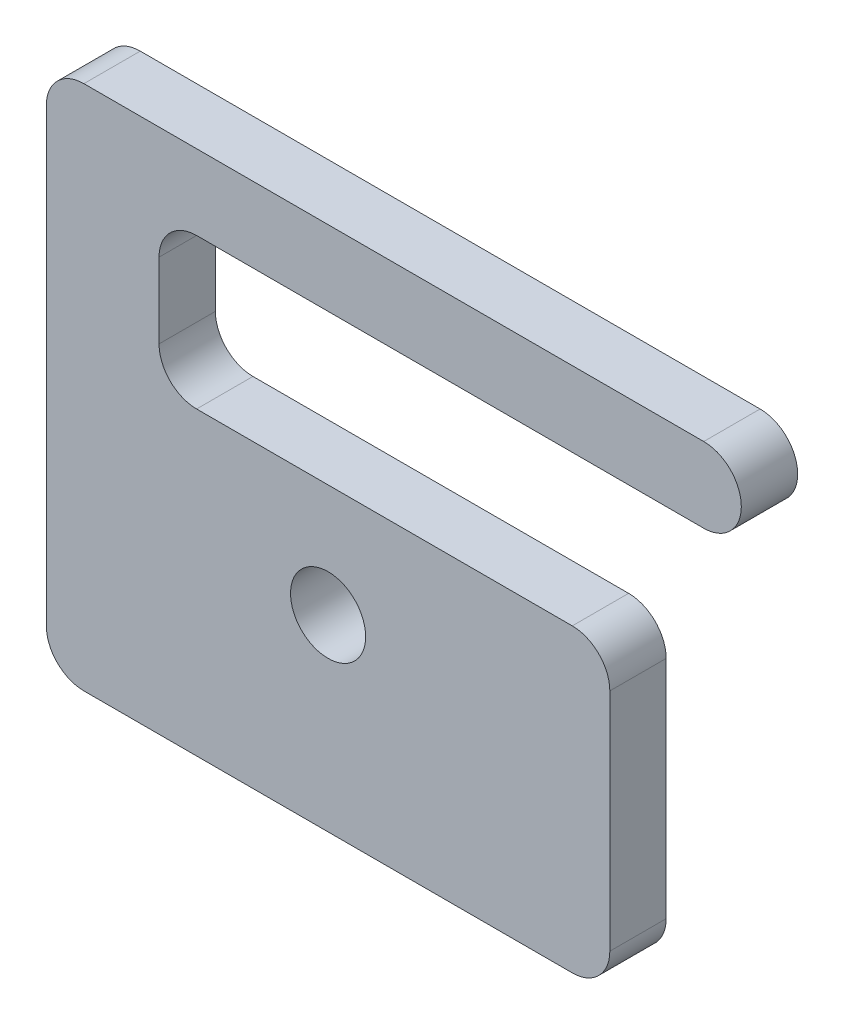
ISO-10303-21;
HEADER;
FILE_DESCRIPTION(('STEP AP214'),'2;1');
FILE_NAME('part.step','',(''),(''),'','','');
FILE_SCHEMA(('AUTOMOTIVE_DESIGN { 1 0 10303 214 1 1 1 1 }'));
ENDSEC;
DATA;
#1=APPLICATION_CONTEXT('core data for automotive mechanical design processes');
#2=APPLICATION_PROTOCOL_DEFINITION('international standard','automotive_design',2000,#1);
#3=PRODUCT_CONTEXT('',#1,'mechanical');
#4=PRODUCT('Part','Part','',(#3));
#5=PRODUCT_RELATED_PRODUCT_CATEGORY('part','',(#4));
#6=PRODUCT_DEFINITION_FORMATION('','',#4);
#7=PRODUCT_DEFINITION_CONTEXT('part definition',#1,'design');
#8=PRODUCT_DEFINITION('design','',#6,#7);
#9=PRODUCT_DEFINITION_SHAPE('','',#8);
#10=(LENGTH_UNIT() NAMED_UNIT(*) SI_UNIT(.MILLI.,.METRE.));
#11=(NAMED_UNIT(*) PLANE_ANGLE_UNIT() SI_UNIT($,.RADIAN.));
#12=(NAMED_UNIT(*) SI_UNIT($,.STERADIAN.) SOLID_ANGLE_UNIT());
#13=UNCERTAINTY_MEASURE_WITH_UNIT(LENGTH_MEASURE(1.E-05),#10,'distance_accuracy_value','');
#14=(GEOMETRIC_REPRESENTATION_CONTEXT(3) GLOBAL_UNCERTAINTY_ASSIGNED_CONTEXT((#13)) GLOBAL_UNIT_ASSIGNED_CONTEXT((#10,
#11,#12)) REPRESENTATION_CONTEXT('',''));
#15=CARTESIAN_POINT('',(0.,0.,0.));
#16=DIRECTION('',(0.,0.,1.));
#17=DIRECTION('',(1.,0.,0.));
#18=AXIS2_PLACEMENT_3D('',#15,#16,#17);
#19=CARTESIAN_POINT('',(-0.35,0.4,-0.15));
#20=DIRECTION('',(0.,0.,1.));
#21=DIRECTION('',(1.,0.,0.));
#22=AXIS2_PLACEMENT_3D('',#19,#20,#21);
#23=CYLINDRICAL_SURFACE('',#22,0.1);
#24=CARTESIAN_POINT('',(-0.35,0.4,0.));
#25=DIRECTION('',(0.,0.,-1.));
#26=DIRECTION('',(1.,0.,0.));
#27=AXIS2_PLACEMENT_3D('',#24,#25,#26);
#28=CIRCLE('',#27,0.1);
#29=CARTESIAN_POINT('',(-0.35,0.3,0.));
#30=VERTEX_POINT('',#29);
#31=CARTESIAN_POINT('',(-0.45,0.400000000000001,0.));
#32=VERTEX_POINT('',#31);
#33=EDGE_CURVE('E178',#30,#32,#28,.T.);
#34=ORIENTED_EDGE('',*,*,#33,.F.);
#35=DIRECTION('',(0.,0.,1.));
#36=VECTOR('',#35,1.);
#37=CARTESIAN_POINT('',(-0.35,0.3,-0.15));
#38=LINE('',#37,#36);
#39=CARTESIAN_POINT('',(-0.35,0.3,-0.15));
#40=VERTEX_POINT('',#39);
#41=EDGE_CURVE('E11',#40,#30,#38,.T.);
#42=ORIENTED_EDGE('',*,*,#41,.F.);
#43=CARTESIAN_POINT('',(-0.35,0.4,-0.15));
#44=DIRECTION('',(0.,0.,-1.));
#45=DIRECTION('',(1.,0.,0.));
#46=AXIS2_PLACEMENT_3D('',#43,#44,#45);
#47=CIRCLE('',#46,0.1);
#48=CARTESIAN_POINT('',(-0.45,0.400000000000001,-0.15));
#49=VERTEX_POINT('',#48);
#50=EDGE_CURVE('E231',#40,#49,#47,.T.);
#51=ORIENTED_EDGE('',*,*,#50,.T.);
#52=DIRECTION('',(0.,0.,1.));
#53=VECTOR('',#52,1.);
#54=CARTESIAN_POINT('',(-0.45,0.400000000000001,-0.15));
#55=LINE('',#54,#53);
#56=EDGE_CURVE('E42',#49,#32,#55,.T.);
#57=ORIENTED_EDGE('',*,*,#56,.T.);
#58=EDGE_LOOP('',(#34,#42,#51,#57));
#59=FACE_BOUND('',#58,.T.);
#60=ADVANCED_FACE('F39',(#59),#23,.F.);
#61=CARTESIAN_POINT('',(-0.35,0.3,-0.15));
#62=DIRECTION('',(0.,1.,0.));
#63=DIRECTION('',(0.,0.,1.));
#64=AXIS2_PLACEMENT_3D('',#61,#62,#63);
#65=PLANE('',#64);
#66=DIRECTION('',(-1.,0.,0.));
#67=VECTOR('',#66,1.);
#68=CARTESIAN_POINT('',(-0.35,0.3,0.));
#69=LINE('',#68,#67);
#70=CARTESIAN_POINT('',(0.65,0.3,0.));
#71=VERTEX_POINT('',#70);
#72=EDGE_CURVE('E228',#71,#30,#69,.T.);
#73=ORIENTED_EDGE('',*,*,#72,.F.);
#74=DIRECTION('',(0.,0.,1.));
#75=VECTOR('',#74,1.);
#76=CARTESIAN_POINT('',(0.65,0.3,-0.15));
#77=LINE('',#76,#75);
#78=CARTESIAN_POINT('',(0.65,0.3,-0.15));
#79=VERTEX_POINT('',#78);
#80=EDGE_CURVE('E49',#79,#71,#77,.T.);
#81=ORIENTED_EDGE('',*,*,#80,.F.);
#82=DIRECTION('',(-1.,0.,0.));
#83=VECTOR('',#82,1.);
#84=CARTESIAN_POINT('',(-0.35,0.3,-0.15));
#85=LINE('',#84,#83);
#86=EDGE_CURVE('E164',#79,#40,#85,.T.);
#87=ORIENTED_EDGE('',*,*,#86,.T.);
#88=ORIENTED_EDGE('',*,*,#41,.T.);
#89=EDGE_LOOP('',(#73,#81,#87,#88));
#90=FACE_BOUND('',#89,.T.);
#91=ADVANCED_FACE('F267',(#90),#65,.T.);
#92=CARTESIAN_POINT('',(0.65,0.2,-0.15));
#93=DIRECTION('',(0.,0.,1.));
#94=DIRECTION('',(1.,0.,0.));
#95=AXIS2_PLACEMENT_3D('',#92,#93,#94);
#96=CYLINDRICAL_SURFACE('',#95,0.1);
#97=CARTESIAN_POINT('',(0.65,0.2,0.));
#98=DIRECTION('',(0.,0.,1.));
#99=DIRECTION('',(-1.,0.,0.));
#100=AXIS2_PLACEMENT_3D('',#97,#98,#99);
#101=CIRCLE('',#100,0.1);
#102=CARTESIAN_POINT('',(0.75,0.199999999999999,0.));
#103=VERTEX_POINT('',#102);
#104=EDGE_CURVE('E150',#103,#71,#101,.T.);
#105=ORIENTED_EDGE('',*,*,#104,.F.);
#106=DIRECTION('',(0.,0.,1.));
#107=VECTOR('',#106,1.);
#108=CARTESIAN_POINT('',(0.75,0.199999999999999,-0.15));
#109=LINE('',#108,#107);
#110=CARTESIAN_POINT('',(0.75,0.199999999999999,-0.15));
#111=VERTEX_POINT('',#110);
#112=EDGE_CURVE('E145',#111,#103,#109,.T.);
#113=ORIENTED_EDGE('',*,*,#112,.F.);
#114=CARTESIAN_POINT('',(0.65,0.2,-0.15));
#115=DIRECTION('',(0.,0.,1.));
#116=DIRECTION('',(-1.,0.,0.));
#117=AXIS2_PLACEMENT_3D('',#114,#115,#116);
#118=CIRCLE('',#117,0.1);
#119=EDGE_CURVE('E148',#111,#79,#118,.T.);
#120=ORIENTED_EDGE('',*,*,#119,.T.);
#121=ORIENTED_EDGE('',*,*,#80,.T.);
#122=EDGE_LOOP('',(#105,#113,#120,#121));
#123=FACE_BOUND('',#122,.T.);
#124=ADVANCED_FACE('F147',(#123),#96,.T.);
#125=CARTESIAN_POINT('',(0.75,0.199999999999999,-0.15));
#126=DIRECTION('',(1.,0.,0.));
#127=DIRECTION('',(0.,1.,0.));
#128=AXIS2_PLACEMENT_3D('',#125,#126,#127);
#129=PLANE('',#128);
#130=DIRECTION('',(0.,1.,0.));
#131=VECTOR('',#130,1.);
#132=CARTESIAN_POINT('',(0.75,0.199999999999999,0.));
#133=LINE('',#132,#131);
#134=CARTESIAN_POINT('',(0.75,-0.4,0.));
#135=VERTEX_POINT('',#134);
#136=EDGE_CURVE('E223',#135,#103,#133,.T.);
#137=ORIENTED_EDGE('',*,*,#136,.F.);
#138=DIRECTION('',(0.,0.,1.));
#139=VECTOR('',#138,1.);
#140=CARTESIAN_POINT('',(0.75,-0.4,-0.15));
#141=LINE('',#140,#139);
#142=CARTESIAN_POINT('',(0.75,-0.4,-0.15));
#143=VERTEX_POINT('',#142);
#144=EDGE_CURVE('E156',#143,#135,#141,.T.);
#145=ORIENTED_EDGE('',*,*,#144,.F.);
#146=DIRECTION('',(0.,1.,0.));
#147=VECTOR('',#146,1.);
#148=CARTESIAN_POINT('',(0.75,0.199999999999999,-0.15));
#149=LINE('',#148,#147);
#150=EDGE_CURVE('E162',#143,#111,#149,.T.);
#151=ORIENTED_EDGE('',*,*,#150,.T.);
#152=ORIENTED_EDGE('',*,*,#112,.T.);
#153=EDGE_LOOP('',(#137,#145,#151,#152));
#154=FACE_BOUND('',#153,.T.);
#155=ADVANCED_FACE('F167',(#154),#129,.T.);
#156=CARTESIAN_POINT('',(0.65,-0.4,-0.15));
#157=DIRECTION('',(0.,0.,1.));
#158=DIRECTION('',(1.,0.,0.));
#159=AXIS2_PLACEMENT_3D('',#156,#157,#158);
#160=CYLINDRICAL_SURFACE('',#159,0.1);
#161=CARTESIAN_POINT('',(0.65,-0.4,0.));
#162=DIRECTION('',(0.,0.,1.));
#163=DIRECTION('',(1.,0.,0.));
#164=AXIS2_PLACEMENT_3D('',#161,#162,#163);
#165=CIRCLE('',#164,0.1);
#166=CARTESIAN_POINT('',(0.649999999999999,-0.5,0.));
#167=VERTEX_POINT('',#166);
#168=EDGE_CURVE('E219',#167,#135,#165,.T.);
#169=ORIENTED_EDGE('',*,*,#168,.F.);
#170=DIRECTION('',(0.,0.,1.));
#171=VECTOR('',#170,1.);
#172=CARTESIAN_POINT('',(0.649999999999999,-0.5,-0.15));
#173=LINE('',#172,#171);
#174=CARTESIAN_POINT('',(0.649999999999999,-0.5,-0.15));
#175=VERTEX_POINT('',#174);
#176=EDGE_CURVE('E237',#175,#167,#173,.T.);
#177=ORIENTED_EDGE('',*,*,#176,.F.);
#178=CARTESIAN_POINT('',(0.65,-0.4,-0.15));
#179=DIRECTION('',(0.,0.,1.));
#180=DIRECTION('',(1.,0.,0.));
#181=AXIS2_PLACEMENT_3D('',#178,#179,#180);
#182=CIRCLE('',#181,0.1);
#183=EDGE_CURVE('E169',#175,#143,#182,.T.);
#184=ORIENTED_EDGE('',*,*,#183,.T.);
#185=ORIENTED_EDGE('',*,*,#144,.T.);
#186=EDGE_LOOP('',(#169,#177,#184,#185));
#187=FACE_BOUND('',#186,.T.);
#188=ADVANCED_FACE('F280',(#187),#160,.T.);
#189=CARTESIAN_POINT('',(-0.649999999999999,-0.5,-0.15));
#190=DIRECTION('',(0.,-1.,0.));
#191=DIRECTION('',(0.,0.,-1.));
#192=AXIS2_PLACEMENT_3D('',#189,#190,#191);
#193=PLANE('',#192);
#194=DIRECTION('',(1.,0.,0.));
#195=VECTOR('',#194,1.);
#196=CARTESIAN_POINT('',(-0.649999999999999,-0.5,0.));
#197=LINE('',#196,#195);
#198=CARTESIAN_POINT('',(-0.649999999999999,-0.5,0.));
#199=VERTEX_POINT('',#198);
#200=EDGE_CURVE('E215',#199,#167,#197,.T.);
#201=ORIENTED_EDGE('',*,*,#200,.F.);
#202=DIRECTION('',(0.,0.,1.));
#203=VECTOR('',#202,1.);
#204=CARTESIAN_POINT('',(-0.649999999999999,-0.5,-0.15));
#205=LINE('',#204,#203);
#206=CARTESIAN_POINT('',(-0.649999999999999,-0.5,-0.15));
#207=VERTEX_POINT('',#206);
#208=EDGE_CURVE('E240',#207,#199,#205,.T.);
#209=ORIENTED_EDGE('',*,*,#208,.F.);
#210=DIRECTION('',(1.,0.,0.));
#211=VECTOR('',#210,1.);
#212=CARTESIAN_POINT('',(-0.649999999999999,-0.5,-0.15));
#213=LINE('',#212,#211);
#214=EDGE_CURVE('E172',#207,#175,#213,.T.);
#215=ORIENTED_EDGE('',*,*,#214,.T.);
#216=ORIENTED_EDGE('',*,*,#176,.T.);
#217=EDGE_LOOP('',(#201,#209,#215,#216));
#218=FACE_BOUND('',#217,.T.);
#219=ADVANCED_FACE('F283',(#218),#193,.T.);
#220=CARTESIAN_POINT('',(-0.65,-0.4,-0.15));
#221=DIRECTION('',(0.,0.,1.));
#222=DIRECTION('',(1.,0.,0.));
#223=AXIS2_PLACEMENT_3D('',#220,#221,#222);
#224=CYLINDRICAL_SURFACE('',#223,0.1);
#225=CARTESIAN_POINT('',(-0.65,-0.4,0.));
#226=DIRECTION('',(0.,0.,1.));
#227=DIRECTION('',(1.,0.,0.));
#228=AXIS2_PLACEMENT_3D('',#225,#226,#227);
#229=CIRCLE('',#228,0.1);
#230=CARTESIAN_POINT('',(-0.75,-0.399999999999999,0.));
#231=VERTEX_POINT('',#230);
#232=EDGE_CURVE('E211',#231,#199,#229,.T.);
#233=ORIENTED_EDGE('',*,*,#232,.F.);
#234=DIRECTION('',(0.,0.,1.));
#235=VECTOR('',#234,1.);
#236=CARTESIAN_POINT('',(-0.75,-0.399999999999999,-0.15));
#237=LINE('',#236,#235);
#238=CARTESIAN_POINT('',(-0.75,-0.399999999999999,-0.15));
#239=VERTEX_POINT('',#238);
#240=EDGE_CURVE('E243',#239,#231,#237,.T.);
#241=ORIENTED_EDGE('',*,*,#240,.F.);
#242=CARTESIAN_POINT('',(-0.65,-0.4,-0.15));
#243=DIRECTION('',(0.,0.,1.));
#244=DIRECTION('',(1.,0.,0.));
#245=AXIS2_PLACEMENT_3D('',#242,#243,#244);
#246=CIRCLE('',#245,0.1);
#247=EDGE_CURVE('E370',#239,#207,#246,.T.);
#248=ORIENTED_EDGE('',*,*,#247,.T.);
#249=ORIENTED_EDGE('',*,*,#208,.T.);
#250=EDGE_LOOP('',(#233,#241,#248,#249));
#251=FACE_BOUND('',#250,.T.);
#252=ADVANCED_FACE('F287',(#251),#224,.T.);
#253=CARTESIAN_POINT('',(-0.75,0.799999999999999,-0.15));
#254=DIRECTION('',(-1.,0.,0.));
#255=DIRECTION('',(0.,-1.,0.));
#256=AXIS2_PLACEMENT_3D('',#253,#254,#255);
#257=PLANE('',#256);
#258=DIRECTION('',(0.,-1.,0.));
#259=VECTOR('',#258,1.);
#260=CARTESIAN_POINT('',(-0.75,0.799999999999999,0.));
#261=LINE('',#260,#259);
#262=CARTESIAN_POINT('',(-0.75,0.799999999999999,0.));
#263=VERTEX_POINT('',#262);
#264=EDGE_CURVE('E207',#263,#231,#261,.T.);
#265=ORIENTED_EDGE('',*,*,#264,.F.);
#266=DIRECTION('',(0.,0.,1.));
#267=VECTOR('',#266,1.);
#268=CARTESIAN_POINT('',(-0.75,0.799999999999999,-0.15));
#269=LINE('',#268,#267);
#270=CARTESIAN_POINT('',(-0.75,0.799999999999999,-0.15));
#271=VERTEX_POINT('',#270);
#272=EDGE_CURVE('E246',#271,#263,#269,.T.);
#273=ORIENTED_EDGE('',*,*,#272,.F.);
#274=DIRECTION('',(0.,-1.,0.));
#275=VECTOR('',#274,1.);
#276=CARTESIAN_POINT('',(-0.75,0.799999999999999,-0.15));
#277=LINE('',#276,#275);
#278=EDGE_CURVE('E366',#271,#239,#277,.T.);
#279=ORIENTED_EDGE('',*,*,#278,.T.);
#280=ORIENTED_EDGE('',*,*,#240,.T.);
#281=EDGE_LOOP('',(#265,#273,#279,#280));
#282=FACE_BOUND('',#281,.T.);
#283=ADVANCED_FACE('F291',(#282),#257,.T.);
#284=CARTESIAN_POINT('',(-0.65,0.8,-0.15));
#285=DIRECTION('',(0.,0.,1.));
#286=DIRECTION('',(1.,0.,0.));
#287=AXIS2_PLACEMENT_3D('',#284,#285,#286);
#288=CYLINDRICAL_SURFACE('',#287,0.1);
#289=CARTESIAN_POINT('',(-0.65,0.8,0.));
#290=DIRECTION('',(0.,0.,1.));
#291=DIRECTION('',(1.,0.,0.));
#292=AXIS2_PLACEMENT_3D('',#289,#290,#291);
#293=CIRCLE('',#292,0.1);
#294=CARTESIAN_POINT('',(-0.65,0.9,0.));
#295=VERTEX_POINT('',#294);
#296=EDGE_CURVE('E203',#295,#263,#293,.T.);
#297=ORIENTED_EDGE('',*,*,#296,.F.);
#298=DIRECTION('',(0.,0.,1.));
#299=VECTOR('',#298,1.);
#300=CARTESIAN_POINT('',(-0.65,0.9,-0.15));
#301=LINE('',#300,#299);
#302=CARTESIAN_POINT('',(-0.65,0.9,-0.15));
#303=VERTEX_POINT('',#302);
#304=EDGE_CURVE('E249',#303,#295,#301,.T.);
#305=ORIENTED_EDGE('',*,*,#304,.F.);
#306=CARTESIAN_POINT('',(-0.65,0.8,-0.15));
#307=DIRECTION('',(0.,0.,1.));
#308=DIRECTION('',(1.,0.,0.));
#309=AXIS2_PLACEMENT_3D('',#306,#307,#308);
#310=CIRCLE('',#309,0.1);
#311=EDGE_CURVE('E362',#303,#271,#310,.T.);
#312=ORIENTED_EDGE('',*,*,#311,.T.);
#313=ORIENTED_EDGE('',*,*,#272,.T.);
#314=EDGE_LOOP('',(#297,#305,#312,#313));
#315=FACE_BOUND('',#314,.T.);
#316=ADVANCED_FACE('F295',(#315),#288,.T.);
#317=CARTESIAN_POINT('',(-0.65,0.9,-0.15));
#318=DIRECTION('',(0.,1.,0.));
#319=DIRECTION('',(-1.,0.,0.));
#320=AXIS2_PLACEMENT_3D('',#317,#318,#319);
#321=PLANE('',#320);
#322=DIRECTION('',(-1.,0.,0.));
#323=VECTOR('',#322,1.);
#324=CARTESIAN_POINT('',(-0.65,0.9,0.));
#325=LINE('',#324,#323);
#326=CARTESIAN_POINT('',(1.,0.9,0.));
#327=VERTEX_POINT('',#326);
#328=EDGE_CURVE('E199',#327,#295,#325,.T.);
#329=ORIENTED_EDGE('',*,*,#328,.F.);
#330=DIRECTION('',(0.,0.,1.));
#331=VECTOR('',#330,1.);
#332=CARTESIAN_POINT('',(1.,0.9,-0.15));
#333=LINE('',#332,#331);
#334=CARTESIAN_POINT('',(1.,0.9,-0.15));
#335=VERTEX_POINT('',#334);
#336=EDGE_CURVE('E252',#335,#327,#333,.T.);
#337=ORIENTED_EDGE('',*,*,#336,.F.);
#338=DIRECTION('',(-1.,0.,0.));
#339=VECTOR('',#338,1.);
#340=CARTESIAN_POINT('',(-0.65,0.9,-0.15));
#341=LINE('',#340,#339);
#342=EDGE_CURVE('E358',#335,#303,#341,.T.);
#343=ORIENTED_EDGE('',*,*,#342,.T.);
#344=ORIENTED_EDGE('',*,*,#304,.T.);
#345=EDGE_LOOP('',(#329,#337,#343,#344));
#346=FACE_BOUND('',#345,.T.);
#347=ADVANCED_FACE('F299',(#346),#321,.T.);
#348=CARTESIAN_POINT('',(1.,0.8,-0.15));
#349=DIRECTION('',(0.,0.,1.));
#350=DIRECTION('',(1.,0.,0.));
#351=AXIS2_PLACEMENT_3D('',#348,#349,#350);
#352=CYLINDRICAL_SURFACE('',#351,0.0999999999999999);
#353=CARTESIAN_POINT('',(1.,0.8,0.));
#354=DIRECTION('',(0.,0.,1.));
#355=DIRECTION('',(1.,0.,0.));
#356=AXIS2_PLACEMENT_3D('',#353,#354,#355);
#357=CIRCLE('',#356,0.0999999999999999);
#358=CARTESIAN_POINT('',(1.,0.7,0.));
#359=VERTEX_POINT('',#358);
#360=EDGE_CURVE('E195',#359,#327,#357,.T.);
#361=ORIENTED_EDGE('',*,*,#360,.F.);
#362=DIRECTION('',(0.,0.,1.));
#363=VECTOR('',#362,1.);
#364=CARTESIAN_POINT('',(1.,0.7,-0.15));
#365=LINE('',#364,#363);
#366=CARTESIAN_POINT('',(1.,0.7,-0.15));
#367=VERTEX_POINT('',#366);
#368=EDGE_CURVE('E255',#367,#359,#365,.T.);
#369=ORIENTED_EDGE('',*,*,#368,.F.);
#370=CARTESIAN_POINT('',(1.,0.8,-0.15));
#371=DIRECTION('',(0.,0.,1.));
#372=DIRECTION('',(1.,0.,0.));
#373=AXIS2_PLACEMENT_3D('',#370,#371,#372);
#374=CIRCLE('',#373,0.0999999999999999);
#375=EDGE_CURVE('E354',#367,#335,#374,.T.);
#376=ORIENTED_EDGE('',*,*,#375,.T.);
#377=ORIENTED_EDGE('',*,*,#336,.T.);
#378=EDGE_LOOP('',(#361,#369,#376,#377));
#379=FACE_BOUND('',#378,.T.);
#380=ADVANCED_FACE('F303',(#379),#352,.T.);
#381=CARTESIAN_POINT('',(-0.35,0.7,-0.15));
#382=DIRECTION('',(0.,-1.,0.));
#383=DIRECTION('',(0.,0.,-1.));
#384=AXIS2_PLACEMENT_3D('',#381,#382,#383);
#385=PLANE('',#384);
#386=DIRECTION('',(1.,0.,0.));
#387=VECTOR('',#386,1.);
#388=CARTESIAN_POINT('',(-0.35,0.7,0.));
#389=LINE('',#388,#387);
#390=CARTESIAN_POINT('',(-0.35,0.7,0.));
#391=VERTEX_POINT('',#390);
#392=EDGE_CURVE('E191',#391,#359,#389,.T.);
#393=ORIENTED_EDGE('',*,*,#392,.F.);
#394=DIRECTION('',(0.,0.,1.));
#395=VECTOR('',#394,1.);
#396=CARTESIAN_POINT('',(-0.35,0.7,-0.15));
#397=LINE('',#396,#395);
#398=CARTESIAN_POINT('',(-0.35,0.7,-0.15));
#399=VERTEX_POINT('',#398);
#400=EDGE_CURVE('E258',#399,#391,#397,.T.);
#401=ORIENTED_EDGE('',*,*,#400,.F.);
#402=DIRECTION('',(1.,0.,0.));
#403=VECTOR('',#402,1.);
#404=CARTESIAN_POINT('',(-0.35,0.7,-0.15));
#405=LINE('',#404,#403);
#406=EDGE_CURVE('E350',#399,#367,#405,.T.);
#407=ORIENTED_EDGE('',*,*,#406,.T.);
#408=ORIENTED_EDGE('',*,*,#368,.T.);
#409=EDGE_LOOP('',(#393,#401,#407,#408));
#410=FACE_BOUND('',#409,.T.);
#411=ADVANCED_FACE('F307',(#410),#385,.T.);
#412=CARTESIAN_POINT('',(-0.35,0.6,-0.15));
#413=DIRECTION('',(0.,0.,1.));
#414=DIRECTION('',(1.,0.,0.));
#415=AXIS2_PLACEMENT_3D('',#412,#413,#414);
#416=CYLINDRICAL_SURFACE('',#415,0.1);
#417=CARTESIAN_POINT('',(-0.35,0.6,0.));
#418=DIRECTION('',(0.,0.,-1.));
#419=DIRECTION('',(1.,0.,0.));
#420=AXIS2_PLACEMENT_3D('',#417,#418,#419);
#421=CIRCLE('',#420,0.1);
#422=CARTESIAN_POINT('',(-0.45,0.599999999999999,0.));
#423=VERTEX_POINT('',#422);
#424=EDGE_CURVE('E187',#423,#391,#421,.T.);
#425=ORIENTED_EDGE('',*,*,#424,.F.);
#426=DIRECTION('',(0.,0.,1.));
#427=VECTOR('',#426,1.);
#428=CARTESIAN_POINT('',(-0.45,0.599999999999999,-0.15));
#429=LINE('',#428,#427);
#430=CARTESIAN_POINT('',(-0.45,0.599999999999999,-0.15));
#431=VERTEX_POINT('',#430);
#432=EDGE_CURVE('E260',#431,#423,#429,.T.);
#433=ORIENTED_EDGE('',*,*,#432,.F.);
#434=CARTESIAN_POINT('',(-0.35,0.6,-0.15));
#435=DIRECTION('',(0.,0.,-1.));
#436=DIRECTION('',(1.,0.,0.));
#437=AXIS2_PLACEMENT_3D('',#434,#435,#436);
#438=CIRCLE('',#437,0.1);
#439=EDGE_CURVE('E346',#431,#399,#438,.T.);
#440=ORIENTED_EDGE('',*,*,#439,.T.);
#441=ORIENTED_EDGE('',*,*,#400,.T.);
#442=EDGE_LOOP('',(#425,#433,#440,#441));
#443=FACE_BOUND('',#442,.T.);
#444=ADVANCED_FACE('F311',(#443),#416,.F.);
#445=CARTESIAN_POINT('',(-0.45,0.599999999999999,-0.15));
#446=DIRECTION('',(1.,0.,0.));
#447=DIRECTION('',(0.,1.,0.));
#448=AXIS2_PLACEMENT_3D('',#445,#446,#447);
#449=PLANE('',#448);
#450=DIRECTION('',(0.,1.,0.));
#451=VECTOR('',#450,1.);
#452=CARTESIAN_POINT('',(-0.45,0.599999999999999,0.));
#453=LINE('',#452,#451);
#454=EDGE_CURVE('E182',#32,#423,#453,.T.);
#455=ORIENTED_EDGE('',*,*,#454,.F.);
#456=ORIENTED_EDGE('',*,*,#56,.F.);
#457=DIRECTION('',(0.,1.,0.));
#458=VECTOR('',#457,1.);
#459=CARTESIAN_POINT('',(-0.45,0.599999999999999,-0.15));
#460=LINE('',#459,#458);
#461=EDGE_CURVE('E343',#49,#431,#460,.T.);
#462=ORIENTED_EDGE('',*,*,#461,.T.);
#463=ORIENTED_EDGE('',*,*,#432,.T.);
#464=EDGE_LOOP('',(#455,#456,#462,#463));
#465=FACE_BOUND('',#464,.T.);
#466=ADVANCED_FACE('F264',(#465),#449,.T.);
#467=CARTESIAN_POINT('',(-0.35,0.4,-0.15));
#468=DIRECTION('',(0.,0.,1.));
#469=DIRECTION('',(1.,0.,0.));
#470=AXIS2_PLACEMENT_3D('',#467,#468,#469);
#471=PLANE('',#470);
#472=CARTESIAN_POINT('',(0.,0.,-0.15));
#473=DIRECTION('',(0.,0.,1.));
#474=DIRECTION('',(1.,0.,0.));
#475=AXIS2_PLACEMENT_3D('',#472,#473,#474);
#476=CIRCLE('',#475,0.1);
#477=CARTESIAN_POINT('',(0.1,0.,-0.15));
#478=VERTEX_POINT('',#477);
#479=EDGE_CURVE('E183',#478,#478,#476,.T.);
#480=ORIENTED_EDGE('',*,*,#479,.T.);
#481=EDGE_LOOP('',(#480));
#482=FACE_BOUND('',#481,.T.);
#483=ORIENTED_EDGE('',*,*,#50,.F.);
#484=ORIENTED_EDGE('',*,*,#86,.F.);
#485=ORIENTED_EDGE('',*,*,#119,.F.);
#486=ORIENTED_EDGE('',*,*,#150,.F.);
#487=ORIENTED_EDGE('',*,*,#183,.F.);
#488=ORIENTED_EDGE('',*,*,#214,.F.);
#489=ORIENTED_EDGE('',*,*,#247,.F.);
#490=ORIENTED_EDGE('',*,*,#278,.F.);
#491=ORIENTED_EDGE('',*,*,#311,.F.);
#492=ORIENTED_EDGE('',*,*,#342,.F.);
#493=ORIENTED_EDGE('',*,*,#375,.F.);
#494=ORIENTED_EDGE('',*,*,#406,.F.);
#495=ORIENTED_EDGE('',*,*,#439,.F.);
#496=ORIENTED_EDGE('',*,*,#461,.F.);
#497=EDGE_LOOP('',(#483,#484,#485,#486,#487,#488,#489,#490,#491,#492,#493,#494,#495,#496));
#498=FACE_BOUND('',#497,.T.);
#499=ADVANCED_FACE('F160',(#482,#498),#471,.F.);
#500=CARTESIAN_POINT('',(-0.35,0.4,0.));
#501=DIRECTION('',(0.,0.,1.));
#502=DIRECTION('',(1.,0.,0.));
#503=AXIS2_PLACEMENT_3D('',#500,#501,#502);
#504=PLANE('',#503);
#505=CARTESIAN_POINT('',(0.,0.,0.));
#506=DIRECTION('',(0.,0.,1.));
#507=DIRECTION('',(1.,0.,0.));
#508=AXIS2_PLACEMENT_3D('',#505,#506,#507);
#509=CIRCLE('',#508,0.1);
#510=CARTESIAN_POINT('',(0.1,0.,0.));
#511=VERTEX_POINT('',#510);
#512=EDGE_CURVE('E335',#511,#511,#509,.T.);
#513=ORIENTED_EDGE('',*,*,#512,.F.);
#514=EDGE_LOOP('',(#513));
#515=FACE_BOUND('',#514,.T.);
#516=ORIENTED_EDGE('',*,*,#33,.T.);
#517=ORIENTED_EDGE('',*,*,#454,.T.);
#518=ORIENTED_EDGE('',*,*,#424,.T.);
#519=ORIENTED_EDGE('',*,*,#392,.T.);
#520=ORIENTED_EDGE('',*,*,#360,.T.);
#521=ORIENTED_EDGE('',*,*,#328,.T.);
#522=ORIENTED_EDGE('',*,*,#296,.T.);
#523=ORIENTED_EDGE('',*,*,#264,.T.);
#524=ORIENTED_EDGE('',*,*,#232,.T.);
#525=ORIENTED_EDGE('',*,*,#200,.T.);
#526=ORIENTED_EDGE('',*,*,#168,.T.);
#527=ORIENTED_EDGE('',*,*,#136,.T.);
#528=ORIENTED_EDGE('',*,*,#104,.T.);
#529=ORIENTED_EDGE('',*,*,#72,.T.);
#530=EDGE_LOOP('',(#516,#517,#518,#519,#520,#521,#522,#523,#524,#525,#526,#527,#528,#529));
#531=FACE_BOUND('',#530,.T.);
#532=ADVANCED_FACE('F266',(#515,#531),#504,.T.);
#533=CARTESIAN_POINT('',(0.,0.,-0.15));
#534=DIRECTION('',(0.,0.,1.));
#535=DIRECTION('',(1.,0.,0.));
#536=AXIS2_PLACEMENT_3D('',#533,#534,#535);
#537=CYLINDRICAL_SURFACE('',#536,0.1);
#538=ORIENTED_EDGE('',*,*,#479,.F.);
#539=EDGE_LOOP('',(#538));
#540=FACE_BOUND('',#539,.T.);
#541=ORIENTED_EDGE('',*,*,#512,.T.);
#542=EDGE_LOOP('',(#541));
#543=FACE_BOUND('',#542,.T.);
#544=ADVANCED_FACE('F323',(#540,#543),#537,.F.);
#545=CLOSED_SHELL('',(#60,#91,#124,#155,#188,#219,#252,#283,#316,#347,#380,#411,#444,#466,#499,
#532,#544));
#546=MANIFOLD_SOLID_BREP('B2',#545);
#547=ADVANCED_BREP_SHAPE_REPRESENTATION('',(#18,#546),#14);
#548=SHAPE_DEFINITION_REPRESENTATION(#9,#547);
ENDSEC;
END-ISO-10303-21;
